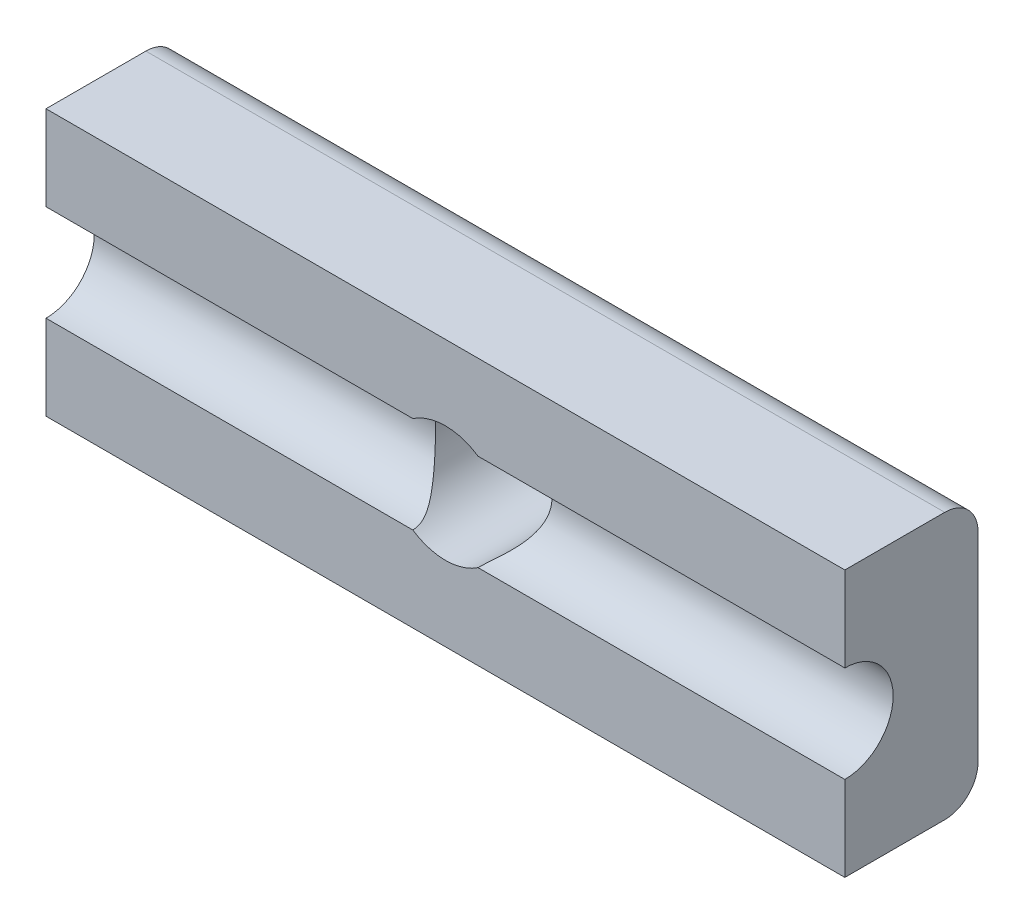
ISO-10303-21;
HEADER;
FILE_DESCRIPTION(('STEP AP214'),'2;1');
FILE_NAME('part.step','',(''),(''),'','','');
FILE_SCHEMA(('AUTOMOTIVE_DESIGN { 1 0 10303 214 1 1 1 1 }'));
ENDSEC;
DATA;
#1=APPLICATION_CONTEXT('core data for automotive mechanical design processes');
#2=APPLICATION_PROTOCOL_DEFINITION('international standard','automotive_design',2000,#1);
#3=PRODUCT_CONTEXT('',#1,'mechanical');
#4=PRODUCT('Part','Part','',(#3));
#5=PRODUCT_RELATED_PRODUCT_CATEGORY('part','',(#4));
#6=PRODUCT_DEFINITION_FORMATION('','',#4);
#7=PRODUCT_DEFINITION_CONTEXT('part definition',#1,'design');
#8=PRODUCT_DEFINITION('design','',#6,#7);
#9=PRODUCT_DEFINITION_SHAPE('','',#8);
#10=(LENGTH_UNIT() NAMED_UNIT(*) SI_UNIT(.MILLI.,.METRE.));
#11=(NAMED_UNIT(*) PLANE_ANGLE_UNIT() SI_UNIT($,.RADIAN.));
#12=(NAMED_UNIT(*) SI_UNIT($,.STERADIAN.) SOLID_ANGLE_UNIT());
#13=UNCERTAINTY_MEASURE_WITH_UNIT(LENGTH_MEASURE(1.E-05),#10,'distance_accuracy_value','');
#14=(GEOMETRIC_REPRESENTATION_CONTEXT(3) GLOBAL_UNCERTAINTY_ASSIGNED_CONTEXT((#13)) GLOBAL_UNIT_ASSIGNED_CONTEXT((#10,
#11,#12)) REPRESENTATION_CONTEXT('',''));
#15=CARTESIAN_POINT('',(0.,0.,0.));
#16=DIRECTION('',(0.,0.,1.));
#17=DIRECTION('',(1.,0.,0.));
#18=AXIS2_PLACEMENT_3D('',#15,#16,#17);
#19=CARTESIAN_POINT('',(0.,0.,4.));
#20=DIRECTION('',(0.,0.,1.));
#21=DIRECTION('',(1.,0.,0.));
#22=AXIS2_PLACEMENT_3D('',#19,#20,#21);
#23=PLANE('',#22);
#24=DIRECTION('',(-1.,0.,0.));
#25=VECTOR('',#24,1.);
#26=CARTESIAN_POINT('',(38.957345971564,1.45,4.));
#27=LINE('',#26,#25);
#28=CARTESIAN_POINT('',(18.957345971564,1.45,4.));
#29=VERTEX_POINT('',#28);
#30=CARTESIAN_POINT('',(7.93714186867725,1.45,4.));
#31=VERTEX_POINT('',#30);
#32=EDGE_CURVE('E125',#29,#31,#27,.T.);
#33=ORIENTED_EDGE('',*,*,#32,.F.);
#34=DIRECTION('',(0.,1.,0.));
#35=VECTOR('',#34,1.);
#36=CARTESIAN_POINT('',(18.957345971564,4.,4.));
#37=LINE('',#36,#35);
#38=CARTESIAN_POINT('',(18.957345971564,4.,4.));
#39=VERTEX_POINT('',#38);
#40=EDGE_CURVE('E142',#29,#39,#37,.T.);
#41=ORIENTED_EDGE('',*,*,#40,.T.);
#42=DIRECTION('',(-1.,0.,0.));
#43=VECTOR('',#42,1.);
#44=CARTESIAN_POINT('',(-5.04265402843602,4.,4.));
#45=LINE('',#44,#43);
#46=CARTESIAN_POINT('',(-5.04265402843602,4.,4.));
#47=VERTEX_POINT('',#46);
#48=EDGE_CURVE('E138',#39,#47,#45,.T.);
#49=ORIENTED_EDGE('',*,*,#48,.T.);
#50=DIRECTION('',(0.,-1.,0.));
#51=VECTOR('',#50,1.);
#52=CARTESIAN_POINT('',(-5.04265402843602,4.,4.));
#53=LINE('',#52,#51);
#54=CARTESIAN_POINT('',(-5.04265402843602,1.45,4.));
#55=VERTEX_POINT('',#54);
#56=EDGE_CURVE('E131',#47,#55,#53,.T.);
#57=ORIENTED_EDGE('',*,*,#56,.T.);
#58=CARTESIAN_POINT('',(5.97755007445071,1.45,4.));
#59=VERTEX_POINT('',#58);
#60=EDGE_CURVE('E111',#59,#55,#27,.T.);
#61=ORIENTED_EDGE('',*,*,#60,.F.);
#62=CARTESIAN_POINT('',(6.95734597156398,0.,4.));
#63=DIRECTION('',(0.,0.,1.));
#64=DIRECTION('',(1.,0.,0.));
#65=AXIS2_PLACEMENT_3D('',#62,#63,#64);
#66=CIRCLE('',#65,1.75);
#67=EDGE_CURVE('E146',#31,#59,#66,.T.);
#68=ORIENTED_EDGE('',*,*,#67,.F.);
#69=EDGE_LOOP('',(#33,#41,#49,#57,#61,#68));
#70=FACE_BOUND('',#69,.T.);
#71=ADVANCED_FACE('F33',(#70),#23,.T.);
#72=CARTESIAN_POINT('',(-5.04265402843602,4.,4.));
#73=DIRECTION('',(1.,0.,0.));
#74=DIRECTION('',(0.,0.,-1.));
#75=AXIS2_PLACEMENT_3D('',#72,#73,#74);
#76=PLANE('',#75);
#77=DIRECTION('',(0.,-1.,0.));
#78=VECTOR('',#77,1.);
#79=CARTESIAN_POINT('',(-5.04265402843602,4.,0.));
#80=LINE('',#79,#78);
#81=CARTESIAN_POINT('',(-5.04265402843602,3.,0.));
#82=VERTEX_POINT('',#81);
#83=CARTESIAN_POINT('',(-5.04265402843602,-3.,0.));
#84=VERTEX_POINT('',#83);
#85=EDGE_CURVE('E154',#82,#84,#80,.T.);
#86=ORIENTED_EDGE('',*,*,#85,.T.);
#87=CARTESIAN_POINT('',(-5.04265402843602,-3.,1.));
#88=DIRECTION('',(1.,0.,0.));
#89=DIRECTION('',(0.,0.,-1.));
#90=AXIS2_PLACEMENT_3D('',#87,#88,#89);
#91=CIRCLE('',#90,1.);
#92=CARTESIAN_POINT('',(-5.04265402843602,-4.,1.));
#93=VERTEX_POINT('',#92);
#94=EDGE_CURVE('E41',#84,#93,#91,.F.);
#95=ORIENTED_EDGE('',*,*,#94,.T.);
#96=DIRECTION('',(0.,0.,-1.));
#97=VECTOR('',#96,1.);
#98=CARTESIAN_POINT('',(-5.04265402843602,-4.,4.));
#99=LINE('',#98,#97);
#100=CARTESIAN_POINT('',(-5.04265402843602,-4.,4.));
#101=VERTEX_POINT('',#100);
#102=EDGE_CURVE('E166',#101,#93,#99,.T.);
#103=ORIENTED_EDGE('',*,*,#102,.F.);
#104=CARTESIAN_POINT('',(-5.04265402843602,-1.45,4.));
#105=VERTEX_POINT('',#104);
#106=EDGE_CURVE('E133',#105,#101,#53,.T.);
#107=ORIENTED_EDGE('',*,*,#106,.F.);
#108=CARTESIAN_POINT('',(-5.04265402843602,0.,4.));
#109=DIRECTION('',(-1.,0.,0.));
#110=DIRECTION('',(0.,0.,1.));
#111=AXIS2_PLACEMENT_3D('',#108,#109,#110);
#112=CIRCLE('',#111,1.45);
#113=EDGE_CURVE('E114',#55,#105,#112,.T.);
#114=ORIENTED_EDGE('',*,*,#113,.F.);
#115=ORIENTED_EDGE('',*,*,#56,.F.);
#116=DIRECTION('',(0.,0.,-1.));
#117=VECTOR('',#116,1.);
#118=CARTESIAN_POINT('',(-5.04265402843602,4.,4.));
#119=LINE('',#118,#117);
#120=CARTESIAN_POINT('',(-5.04265402843602,4.,1.));
#121=VERTEX_POINT('',#120);
#122=EDGE_CURVE('E153',#47,#121,#119,.T.);
#123=ORIENTED_EDGE('',*,*,#122,.T.);
#124=CARTESIAN_POINT('',(-5.04265402843602,3.,1.));
#125=DIRECTION('',(1.,0.,0.));
#126=DIRECTION('',(0.,0.,-1.));
#127=AXIS2_PLACEMENT_3D('',#124,#125,#126);
#128=CIRCLE('',#127,1.);
#129=EDGE_CURVE('E48',#121,#82,#128,.F.);
#130=ORIENTED_EDGE('',*,*,#129,.T.);
#131=EDGE_LOOP('',(#86,#95,#103,#107,#114,#115,#123,#130));
#132=FACE_BOUND('',#131,.T.);
#133=ADVANCED_FACE('F129',(#132),#76,.F.);
#134=CARTESIAN_POINT('',(-5.04265402843602,-4.,4.));
#135=DIRECTION('',(0.,1.,0.));
#136=DIRECTION('',(0.,0.,1.));
#137=AXIS2_PLACEMENT_3D('',#134,#135,#136);
#138=PLANE('',#137);
#139=ORIENTED_EDGE('',*,*,#102,.T.);
#140=DIRECTION('',(1.,0.,0.));
#141=VECTOR('',#140,1.);
#142=CARTESIAN_POINT('',(-5.04265402843602,-4.,1.));
#143=LINE('',#142,#141);
#144=CARTESIAN_POINT('',(18.957345971564,-4.,1.));
#145=VERTEX_POINT('',#144);
#146=EDGE_CURVE('E229',#93,#145,#143,.T.);
#147=ORIENTED_EDGE('',*,*,#146,.T.);
#148=DIRECTION('',(0.,0.,-1.));
#149=VECTOR('',#148,1.);
#150=CARTESIAN_POINT('',(18.957345971564,-4.,4.));
#151=LINE('',#150,#149);
#152=CARTESIAN_POINT('',(18.957345971564,-4.,4.));
#153=VERTEX_POINT('',#152);
#154=EDGE_CURVE('E163',#153,#145,#151,.T.);
#155=ORIENTED_EDGE('',*,*,#154,.F.);
#156=DIRECTION('',(1.,0.,0.));
#157=VECTOR('',#156,1.);
#158=CARTESIAN_POINT('',(-5.04265402843602,-4.,4.));
#159=LINE('',#158,#157);
#160=EDGE_CURVE('E140',#101,#153,#159,.T.);
#161=ORIENTED_EDGE('',*,*,#160,.F.);
#162=EDGE_LOOP('',(#139,#147,#155,#161));
#163=FACE_BOUND('',#162,.T.);
#164=ADVANCED_FACE('F204',(#163),#138,.F.);
#165=CARTESIAN_POINT('',(18.957345971564,4.,4.));
#166=DIRECTION('',(-1.,0.,0.));
#167=DIRECTION('',(0.,0.,1.));
#168=AXIS2_PLACEMENT_3D('',#165,#166,#167);
#169=PLANE('',#168);
#170=ORIENTED_EDGE('',*,*,#154,.T.);
#171=CARTESIAN_POINT('',(18.957345971564,-3.,1.));
#172=DIRECTION('',(-1.,0.,0.));
#173=DIRECTION('',(0.,0.,1.));
#174=AXIS2_PLACEMENT_3D('',#171,#172,#173);
#175=CIRCLE('',#174,1.);
#176=CARTESIAN_POINT('',(18.957345971564,-3.,0.));
#177=VERTEX_POINT('',#176);
#178=EDGE_CURVE('E235',#145,#177,#175,.F.);
#179=ORIENTED_EDGE('',*,*,#178,.T.);
#180=DIRECTION('',(0.,1.,0.));
#181=VECTOR('',#180,1.);
#182=CARTESIAN_POINT('',(18.957345971564,4.,0.));
#183=LINE('',#182,#181);
#184=CARTESIAN_POINT('',(18.957345971564,3.,0.));
#185=VERTEX_POINT('',#184);
#186=EDGE_CURVE('E144',#177,#185,#183,.T.);
#187=ORIENTED_EDGE('',*,*,#186,.T.);
#188=CARTESIAN_POINT('',(18.957345971564,3.,1.));
#189=DIRECTION('',(-1.,0.,0.));
#190=DIRECTION('',(0.,0.,1.));
#191=AXIS2_PLACEMENT_3D('',#188,#189,#190);
#192=CIRCLE('',#191,1.);
#193=CARTESIAN_POINT('',(18.957345971564,4.,1.));
#194=VERTEX_POINT('',#193);
#195=EDGE_CURVE('E231',#185,#194,#192,.F.);
#196=ORIENTED_EDGE('',*,*,#195,.T.);
#197=DIRECTION('',(0.,0.,-1.));
#198=VECTOR('',#197,1.);
#199=CARTESIAN_POINT('',(18.957345971564,4.,4.));
#200=LINE('',#199,#198);
#201=EDGE_CURVE('E160',#39,#194,#200,.T.);
#202=ORIENTED_EDGE('',*,*,#201,.F.);
#203=ORIENTED_EDGE('',*,*,#40,.F.);
#204=CARTESIAN_POINT('',(18.957345971564,0.,4.));
#205=DIRECTION('',(-1.,0.,0.));
#206=DIRECTION('',(0.,0.,1.));
#207=AXIS2_PLACEMENT_3D('',#204,#205,#206);
#208=CIRCLE('',#207,1.45);
#209=CARTESIAN_POINT('',(18.957345971564,-1.45,4.));
#210=VERTEX_POINT('',#209);
#211=EDGE_CURVE('E223',#29,#210,#208,.T.);
#212=ORIENTED_EDGE('',*,*,#211,.T.);
#213=EDGE_CURVE('E149',#153,#210,#37,.T.);
#214=ORIENTED_EDGE('',*,*,#213,.F.);
#215=EDGE_LOOP('',(#170,#179,#187,#196,#202,#203,#212,#214));
#216=FACE_BOUND('',#215,.T.);
#217=ADVANCED_FACE('F216',(#216),#169,.F.);
#218=CARTESIAN_POINT('',(-5.04265402843602,4.,4.));
#219=DIRECTION('',(0.,-1.,0.));
#220=DIRECTION('',(0.,0.,-1.));
#221=AXIS2_PLACEMENT_3D('',#218,#219,#220);
#222=PLANE('',#221);
#223=ORIENTED_EDGE('',*,*,#201,.T.);
#224=DIRECTION('',(-1.,0.,0.));
#225=VECTOR('',#224,1.);
#226=CARTESIAN_POINT('',(-5.04265402843602,4.,1.));
#227=LINE('',#226,#225);
#228=EDGE_CURVE('E11',#194,#121,#227,.T.);
#229=ORIENTED_EDGE('',*,*,#228,.T.);
#230=ORIENTED_EDGE('',*,*,#122,.F.);
#231=ORIENTED_EDGE('',*,*,#48,.F.);
#232=EDGE_LOOP('',(#223,#229,#230,#231));
#233=FACE_BOUND('',#232,.T.);
#234=ADVANCED_FACE('F209',(#233),#222,.F.);
#235=DIRECTION('',(-1.,0.,0.));
#236=VECTOR('',#235,1.);
#237=CARTESIAN_POINT('',(38.957345971564,-1.45,4.));
#238=LINE('',#237,#236);
#239=CARTESIAN_POINT('',(5.97755007445071,-1.45,4.));
#240=VERTEX_POINT('',#239);
#241=EDGE_CURVE('E123',#105,#240,#238,.F.);
#242=ORIENTED_EDGE('',*,*,#241,.F.);
#243=ORIENTED_EDGE('',*,*,#106,.T.);
#244=ORIENTED_EDGE('',*,*,#160,.T.);
#245=ORIENTED_EDGE('',*,*,#213,.T.);
#246=CARTESIAN_POINT('',(7.93714186867725,-1.45,4.));
#247=VERTEX_POINT('',#246);
#248=EDGE_CURVE('E134',#247,#210,#238,.F.);
#249=ORIENTED_EDGE('',*,*,#248,.F.);
#250=EDGE_CURVE('E122',#240,#247,#66,.T.);
#251=ORIENTED_EDGE('',*,*,#250,.F.);
#252=EDGE_LOOP('',(#242,#243,#244,#245,#249,#251));
#253=FACE_BOUND('',#252,.T.);
#254=ADVANCED_FACE('F200',(#253),#23,.T.);
#255=CARTESIAN_POINT('',(0.,0.,0.));
#256=DIRECTION('',(0.,0.,1.));
#257=DIRECTION('',(1.,0.,0.));
#258=AXIS2_PLACEMENT_3D('',#255,#256,#257);
#259=PLANE('',#258);
#260=CARTESIAN_POINT('',(6.95734597156398,0.,0.));
#261=DIRECTION('',(0.,0.,1.));
#262=DIRECTION('',(1.,0.,0.));
#263=AXIS2_PLACEMENT_3D('',#260,#261,#262);
#264=CIRCLE('',#263,1.75);
#265=CARTESIAN_POINT('',(8.70734597156398,0.,0.));
#266=VERTEX_POINT('',#265);
#267=EDGE_CURVE('E156',#266,#266,#264,.T.);
#268=ORIENTED_EDGE('',*,*,#267,.T.);
#269=EDGE_LOOP('',(#268));
#270=FACE_BOUND('',#269,.T.);
#271=ORIENTED_EDGE('',*,*,#186,.F.);
#272=DIRECTION('',(1.,0.,0.));
#273=VECTOR('',#272,1.);
#274=CARTESIAN_POINT('',(0.,-3.,0.));
#275=LINE('',#274,#273);
#276=EDGE_CURVE('E55',#177,#84,#275,.F.);
#277=ORIENTED_EDGE('',*,*,#276,.T.);
#278=ORIENTED_EDGE('',*,*,#85,.F.);
#279=DIRECTION('',(-1.,0.,0.));
#280=VECTOR('',#279,1.);
#281=CARTESIAN_POINT('',(0.,3.,0.));
#282=LINE('',#281,#280);
#283=EDGE_CURVE('E239',#82,#185,#282,.F.);
#284=ORIENTED_EDGE('',*,*,#283,.T.);
#285=EDGE_LOOP('',(#271,#277,#278,#284));
#286=FACE_BOUND('',#285,.T.);
#287=ADVANCED_FACE('F208',(#270,#286),#259,.F.);
#288=CARTESIAN_POINT('',(6.95734597156398,0.,-1.));
#289=DIRECTION('',(0.,0.,1.));
#290=DIRECTION('',(1.,0.,0.));
#291=AXIS2_PLACEMENT_3D('',#288,#289,#290);
#292=CYLINDRICAL_SURFACE('',#291,1.75);
#293=ORIENTED_EDGE('',*,*,#67,.T.);
#294=CARTESIAN_POINT('',(5.97755007445071,1.45,4.));
#295=CARTESIAN_POINT('',(5.97756500117305,1.45000457422705,3.97384849977603));
#296=CARTESIAN_POINT('',(5.97650209439802,1.44929222429545,3.94771467125591));
#297=CARTESIAN_POINT('',(5.97235437263121,1.44647897993039,3.89573135695613));
#298=CARTESIAN_POINT('',(5.96927338131075,1.44438071133856,3.86988142726166));
#299=CARTESIAN_POINT('',(5.95731759020673,1.43615370707763,3.79375040887032));
#300=CARTESIAN_POINT('',(5.94572169926277,1.42808967889254,3.74409305841648));
#301=CARTESIAN_POINT('',(5.91149070403954,1.40330869781839,3.62855739178309));
#302=CARTESIAN_POINT('',(5.8863115663605,1.38444070148726,3.56393400281107));
#303=CARTESIAN_POINT('',(5.83003670842969,1.33902864862551,3.4397150939739));
#304=CARTESIAN_POINT('',(5.79889338054189,1.31242186645739,3.38016601777156));
#305=CARTESIAN_POINT('',(5.72020693465349,1.23934082224885,3.24169012741478));
#306=CARTESIAN_POINT('',(5.6713608486516,1.18924040640139,3.16541247821936));
#307=CARTESIAN_POINT('',(5.57480829088617,1.07548605748851,3.0232305228156));
#308=CARTESIAN_POINT('',(5.52709960065118,1.01186140859376,2.9573043303406));
#309=CARTESIAN_POINT('',(5.44665615324683,0.885820874251595,2.84971077641952));
#310=CARTESIAN_POINT('',(5.41287885435318,0.82594704764604,2.80585507684761));
#311=CARTESIAN_POINT('',(5.35102604386954,0.698041486917739,2.72686727468147));
#312=CARTESIAN_POINT('',(5.32294257694388,0.630021349185375,2.69172298513018));
#313=CARTESIAN_POINT('',(5.27886763368557,0.499129245158665,2.63709834010694));
#314=CARTESIAN_POINT('',(5.26162886338168,0.437371421621348,2.61596600335409));
#315=CARTESIAN_POINT('',(5.23382276329896,0.310154945983892,2.58203393584242));
#316=CARTESIAN_POINT('',(5.223251429842,0.244698540598185,2.56922920435944));
#317=CARTESIAN_POINT('',(5.20962127174574,0.111580591040525,2.55273930984938));
#318=CARTESIAN_POINT('',(5.20659324094626,0.0439111468115775,2.54909152754864));
#319=CARTESIAN_POINT('',(5.20841769418046,-0.0911641079271342,2.55129347080933));
#320=CARTESIAN_POINT('',(5.21326990891822,-0.158569927366984,2.55714287181834));
#321=CARTESIAN_POINT('',(5.22984867686324,-0.286622518180135,2.57722947355189));
#322=CARTESIAN_POINT('',(5.24110581283742,-0.347423276441562,2.59089421256889));
#323=CARTESIAN_POINT('',(5.26931304456847,-0.465549515161636,2.62538970240973));
#324=CARTESIAN_POINT('',(5.2862646958698,-0.522874040977381,2.64622241131255));
#325=CARTESIAN_POINT('',(5.32653390305427,-0.637956143401909,2.6962408805728));
#326=CARTESIAN_POINT('',(5.35027860362642,-0.695312963489974,2.72599791358064));
#327=CARTESIAN_POINT('',(5.40191707986062,-0.804226103134157,2.79178884168476));
#328=CARTESIAN_POINT('',(5.42981248979389,-0.855780123829566,2.82782521012295));
#329=CARTESIAN_POINT('',(5.49450211684261,-0.962950426490749,2.91332843620849));
#330=CARTESIAN_POINT('',(5.53194156392674,-1.01718860600642,2.96403041505188));
#331=CARTESIAN_POINT('',(5.60863254791461,-1.11688502520383,3.07236836026789));
#332=CARTESIAN_POINT('',(5.64788692506919,-1.16232888356559,3.13001543833536));
#333=CARTESIAN_POINT('',(5.72548404719611,-1.24426367205696,3.25186458357728));
#334=CARTESIAN_POINT('',(5.76382715161694,-1.28075818699029,3.3160640114604));
#335=CARTESIAN_POINT('',(5.83589437737127,-1.34429648993672,3.45142310760666));
#336=CARTESIAN_POINT('',(5.86962763939525,-1.37135915031809,3.52256850791145));
#337=CARTESIAN_POINT('',(5.91615081475778,-1.40674854147237,3.64501345530275));
#338=CARTESIAN_POINT('',(5.93209943304017,-1.41831071839284,3.69415368485867));
#339=CARTESIAN_POINT('',(5.95748642101113,-1.4363250322144,3.79491097437534));
#340=CARTESIAN_POINT('',(5.96695206406724,-1.44279859372886,3.84651666883369));
#341=CARTESIAN_POINT('',(5.97405537964072,-1.44763330300081,3.91547572712931));
#342=CARTESIAN_POINT('',(5.97536113847718,-1.44851882636465,3.93232727036138));
#343=CARTESIAN_POINT('',(5.97710920250282,-1.44970241852713,3.96611676632377));
#344=CARTESIAN_POINT('',(5.97755042091326,-1.44999974793548,3.98305480101173));
#345=CARTESIAN_POINT('',(5.97755007445071,-1.45,4.));
#346=B_SPLINE_CURVE_WITH_KNOTS('',3,(#294,#295,#296,#297,#298,#299,#300,#301,#302,#303,#304,
#305,#306,#307,#308,#309,#310,#311,#312,#313,#314,#315,#316,#317,#318,#319,#320,#321,#322,#323,
#324,#325,#326,#327,#328,#329,#330,#331,#332,#333,#334,#335,#336,#337,#338,#339,#340,#341,#342,
#343,#344,#345),.UNSPECIFIED.,.F.,.F.,(4,2,2,2,2,2,2,2,2,2,2,2,2,2,2,2,2,2,2,2,2,2,2,2,2,4),(0.,
0.0783924037094106,0.156636705056378,0.310777259551677,0.525225330081149,0.741462470550052,
1.05048404321804,1.35884318290749,1.6025672508554,1.8459484082501,2.04763753302633,
2.24920543144687,2.45159484698619,2.65397734630737,2.84314877946327,3.03237192978362,
3.23814732582164,3.44400395786971,3.69259126394255,3.94158171098837,4.19047225738098,
4.43886189579678,4.59717516506756,4.75481826305044,4.80556791861546,4.85638132869327),.UNSPECIFIED.);
#347=EDGE_CURVE('E117',#59,#240,#346,.T.);
#348=ORIENTED_EDGE('',*,*,#347,.T.);
#349=ORIENTED_EDGE('',*,*,#250,.T.);
#350=CARTESIAN_POINT('',(7.93714186867725,-1.45,4.));
#351=CARTESIAN_POINT('',(7.93712694195492,-1.45000457422705,3.97384849977603));
#352=CARTESIAN_POINT('',(7.93818984872994,-1.44929222429545,3.94771467125591));
#353=CARTESIAN_POINT('',(7.94233757049676,-1.44647897993039,3.89573135695613));
#354=CARTESIAN_POINT('',(7.94541856181722,-1.44438071133856,3.86988142726166));
#355=CARTESIAN_POINT('',(7.95737435292124,-1.43615370707763,3.79375040887032));
#356=CARTESIAN_POINT('',(7.96897024386519,-1.42808967889254,3.74409305841648));
#357=CARTESIAN_POINT('',(8.00320123908842,-1.40330869781839,3.62855739178309));
#358=CARTESIAN_POINT('',(8.02838037676746,-1.38444070148726,3.56393400281107));
#359=CARTESIAN_POINT('',(8.08465523469828,-1.33902864862552,3.4397150939739));
#360=CARTESIAN_POINT('',(8.11579856258607,-1.31242186645739,3.38016601777156));
#361=CARTESIAN_POINT('',(8.19448500847448,-1.23934082224885,3.24169012741478));
#362=CARTESIAN_POINT('',(8.24333109447637,-1.18924040640139,3.16541247821936));
#363=CARTESIAN_POINT('',(8.3398836522418,-1.07548605748851,3.0232305228156));
#364=CARTESIAN_POINT('',(8.38759234247678,-1.01186140859376,2.9573043303406));
#365=CARTESIAN_POINT('',(8.46803578988114,-0.885820874251595,2.84971077641952));
#366=CARTESIAN_POINT('',(8.50181308877479,-0.82594704764604,2.80585507684761));
#367=CARTESIAN_POINT('',(8.56366589925842,-0.698041486917739,2.72686727468147));
#368=CARTESIAN_POINT('',(8.59174936618408,-0.630021349185374,2.69172298513018));
#369=CARTESIAN_POINT('',(8.6358243094424,-0.499129245158664,2.63709834010694));
#370=CARTESIAN_POINT('',(8.65306307974629,-0.437371421621347,2.61596600335409));
#371=CARTESIAN_POINT('',(8.680869179829,-0.310154945983892,2.58203393584242));
#372=CARTESIAN_POINT('',(8.69144051328596,-0.244698540598184,2.56922920435944));
#373=CARTESIAN_POINT('',(8.70507067138222,-0.111580591040524,2.55273930984938));
#374=CARTESIAN_POINT('',(8.7080987021817,-0.0439111468115767,2.54909152754864));
#375=CARTESIAN_POINT('',(8.7062742489475,0.091164107927135,2.55129347080933));
#376=CARTESIAN_POINT('',(8.70142203420975,0.158569927366985,2.55714287181834));
#377=CARTESIAN_POINT('',(8.68484326626472,0.286622518180136,2.57722947355189));
#378=CARTESIAN_POINT('',(8.67358613029054,0.347423276441563,2.59089421256889));
#379=CARTESIAN_POINT('',(8.64537889855949,0.465549515161637,2.62538970240973));
#380=CARTESIAN_POINT('',(8.62842724725817,0.522874040977382,2.64622241131255));
#381=CARTESIAN_POINT('',(8.58815804007369,0.63795614340191,2.6962408805728));
#382=CARTESIAN_POINT('',(8.56441333950154,0.695312963489974,2.72599791358064));
#383=CARTESIAN_POINT('',(8.51277486326734,0.804226103134157,2.79178884168476));
#384=CARTESIAN_POINT('',(8.48487945333408,0.855780123829566,2.82782521012295));
#385=CARTESIAN_POINT('',(8.42018982628535,0.96295042649075,2.91332843620849));
#386=CARTESIAN_POINT('',(8.38275037920122,1.01718860600642,2.96403041505188));
#387=CARTESIAN_POINT('',(8.30605939521335,1.11688502520383,3.07236836026789));
#388=CARTESIAN_POINT('',(8.26680501805877,1.16232888356559,3.13001543833536));
#389=CARTESIAN_POINT('',(8.18920789593185,1.24426367205696,3.25186458357728));
#390=CARTESIAN_POINT('',(8.15086479151103,1.28075818699029,3.3160640114604));
#391=CARTESIAN_POINT('',(8.07879756575669,1.34429648993672,3.45142310760666));
#392=CARTESIAN_POINT('',(8.04506430373272,1.37135915031809,3.52256850791145));
#393=CARTESIAN_POINT('',(7.99854112837019,1.40674854147237,3.64501345530275));
#394=CARTESIAN_POINT('',(7.9825925100878,1.41831071839284,3.69415368485867));
#395=CARTESIAN_POINT('',(7.95720552211683,1.4363250322144,3.79491097437534));
#396=CARTESIAN_POINT('',(7.94773987906073,1.44279859372886,3.84651666883369));
#397=CARTESIAN_POINT('',(7.94063656348725,1.44763330300081,3.91547572712931));
#398=CARTESIAN_POINT('',(7.93933080465079,1.44851882636465,3.93232727036138));
#399=CARTESIAN_POINT('',(7.93758274062514,1.44970241852713,3.96611676632377));
#400=CARTESIAN_POINT('',(7.93714152221471,1.44999974793548,3.98305480101173));
#401=CARTESIAN_POINT('',(7.93714186867725,1.45,4.));
#402=B_SPLINE_CURVE_WITH_KNOTS('',3,(#350,#351,#352,#353,#354,#355,#356,#357,#358,#359,#360,
#361,#362,#363,#364,#365,#366,#367,#368,#369,#370,#371,#372,#373,#374,#375,#376,#377,#378,#379,
#380,#381,#382,#383,#384,#385,#386,#387,#388,#389,#390,#391,#392,#393,#394,#395,#396,#397,#398,
#399,#400,#401),.UNSPECIFIED.,.F.,.F.,(4,2,2,2,2,2,2,2,2,2,2,2,2,2,2,2,2,2,2,2,2,2,2,2,2,4),(0.,
0.0783924037094106,0.156636705056378,0.310777259551677,0.525225330081148,0.741462470550052,
1.05048404321804,1.3588431829075,1.6025672508554,1.8459484082501,2.04763753302633,
2.24920543144687,2.45159484698619,2.65397734630737,2.84314877946327,3.03237192978362,
3.23814732582164,3.44400395786971,3.69259126394255,3.94158171098837,4.19047225738098,
4.43886189579678,4.59717516506756,4.75481826305044,4.80556791861546,4.85638132869327),.UNSPECIFIED.);
#403=EDGE_CURVE('E169',#247,#31,#402,.T.);
#404=ORIENTED_EDGE('',*,*,#403,.T.);
#405=EDGE_LOOP('',(#293,#348,#349,#404));
#406=FACE_BOUND('',#405,.T.);
#407=ORIENTED_EDGE('',*,*,#267,.F.);
#408=EDGE_LOOP('',(#407));
#409=FACE_BOUND('',#408,.T.);
#410=ADVANCED_FACE('F185',(#406,#409),#292,.F.);
#411=CARTESIAN_POINT('',(38.957345971564,0.,4.));
#412=DIRECTION('',(-1.,0.,0.));
#413=DIRECTION('',(0.,0.,1.));
#414=AXIS2_PLACEMENT_3D('',#411,#412,#413);
#415=CYLINDRICAL_SURFACE('',#414,1.45);
#416=ORIENTED_EDGE('',*,*,#32,.T.);
#417=ORIENTED_EDGE('',*,*,#403,.F.);
#418=ORIENTED_EDGE('',*,*,#248,.T.);
#419=ORIENTED_EDGE('',*,*,#211,.F.);
#420=EDGE_LOOP('',(#416,#417,#418,#419));
#421=FACE_BOUND('',#420,.T.);
#422=ADVANCED_FACE('F191',(#421),#415,.F.);
#423=ORIENTED_EDGE('',*,*,#60,.T.);
#424=ORIENTED_EDGE('',*,*,#113,.T.);
#425=ORIENTED_EDGE('',*,*,#241,.T.);
#426=ORIENTED_EDGE('',*,*,#347,.F.);
#427=EDGE_LOOP('',(#423,#424,#425,#426));
#428=FACE_BOUND('',#427,.T.);
#429=ADVANCED_FACE('F113',(#428),#415,.F.);
#430=CARTESIAN_POINT('',(-5.04265402843602,-3.,1.));
#431=DIRECTION('',(1.,0.,0.));
#432=DIRECTION('',(0.,0.,-1.));
#433=AXIS2_PLACEMENT_3D('',#430,#431,#432);
#434=CYLINDRICAL_SURFACE('',#433,1.);
#435=ORIENTED_EDGE('',*,*,#94,.F.);
#436=ORIENTED_EDGE('',*,*,#276,.F.);
#437=ORIENTED_EDGE('',*,*,#178,.F.);
#438=ORIENTED_EDGE('',*,*,#146,.F.);
#439=EDGE_LOOP('',(#435,#436,#437,#438));
#440=FACE_BOUND('',#439,.T.);
#441=ADVANCED_FACE('F190',(#440),#434,.T.);
#442=CARTESIAN_POINT('',(-5.04265402843602,3.,1.));
#443=DIRECTION('',(-1.,0.,0.));
#444=DIRECTION('',(0.,0.,1.));
#445=AXIS2_PLACEMENT_3D('',#442,#443,#444);
#446=CYLINDRICAL_SURFACE('',#445,1.);
#447=ORIENTED_EDGE('',*,*,#195,.F.);
#448=ORIENTED_EDGE('',*,*,#283,.F.);
#449=ORIENTED_EDGE('',*,*,#129,.F.);
#450=ORIENTED_EDGE('',*,*,#228,.F.);
#451=EDGE_LOOP('',(#447,#448,#449,#450));
#452=FACE_BOUND('',#451,.T.);
#453=ADVANCED_FACE('F35',(#452),#446,.T.);
#454=CLOSED_SHELL('',(#71,#133,#164,#217,#234,#254,#287,#410,#422,#429,#441,#453));
#455=MANIFOLD_SOLID_BREP('B2',#454);
#456=ADVANCED_BREP_SHAPE_REPRESENTATION('',(#18,#455),#14);
#457=SHAPE_DEFINITION_REPRESENTATION(#9,#456);
ENDSEC;
END-ISO-10303-21;
